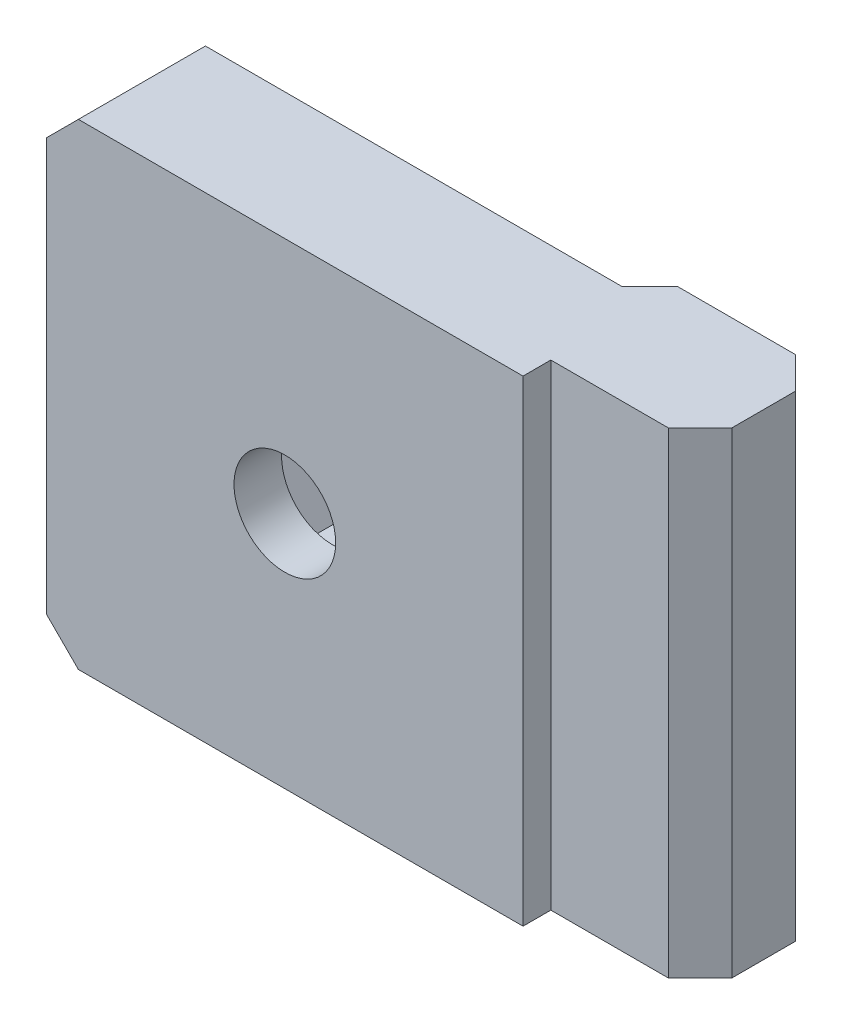
ISO-10303-21;
HEADER;
FILE_DESCRIPTION(('STEP AP214'),'2;1');
FILE_NAME('part.step','',(''),(''),'','','');
FILE_SCHEMA(('AUTOMOTIVE_DESIGN { 1 0 10303 214 1 1 1 1 }'));
ENDSEC;
DATA;
#1=APPLICATION_CONTEXT('core data for automotive mechanical design processes');
#2=APPLICATION_PROTOCOL_DEFINITION('international standard','automotive_design',2000,#1);
#3=PRODUCT_CONTEXT('',#1,'mechanical');
#4=PRODUCT('Part','Part','',(#3));
#5=PRODUCT_RELATED_PRODUCT_CATEGORY('part','',(#4));
#6=PRODUCT_DEFINITION_FORMATION('','',#4);
#7=PRODUCT_DEFINITION_CONTEXT('part definition',#1,'design');
#8=PRODUCT_DEFINITION('design','',#6,#7);
#9=PRODUCT_DEFINITION_SHAPE('','',#8);
#10=(LENGTH_UNIT() NAMED_UNIT(*) SI_UNIT(.MILLI.,.METRE.));
#11=(NAMED_UNIT(*) PLANE_ANGLE_UNIT() SI_UNIT($,.RADIAN.));
#12=(NAMED_UNIT(*) SI_UNIT($,.STERADIAN.) SOLID_ANGLE_UNIT());
#13=UNCERTAINTY_MEASURE_WITH_UNIT(LENGTH_MEASURE(1.E-05),#10,'distance_accuracy_value','');
#14=(GEOMETRIC_REPRESENTATION_CONTEXT(3) GLOBAL_UNCERTAINTY_ASSIGNED_CONTEXT((#13)) GLOBAL_UNIT_ASSIGNED_CONTEXT((#10,
#11,#12)) REPRESENTATION_CONTEXT('',''));
#15=CARTESIAN_POINT('',(0.,0.,0.));
#16=DIRECTION('',(0.,0.,1.));
#17=DIRECTION('',(1.,0.,0.));
#18=AXIS2_PLACEMENT_3D('',#15,#16,#17);
#19=CARTESIAN_POINT('',(0.,15.,-1.75));
#20=DIRECTION('',(-1.,0.,0.));
#21=DIRECTION('',(0.,0.,1.));
#22=AXIS2_PLACEMENT_3D('',#19,#20,#21);
#23=PLANE('',#22);
#24=DIRECTION('',(0.,0.,-1.));
#25=VECTOR('',#24,1.);
#26=CARTESIAN_POINT('',(0.,-15.,-1.75));
#27=LINE('',#26,#25);
#28=CARTESIAN_POINT('',(0.,-15.,0.));
#29=VERTEX_POINT('',#28);
#30=CARTESIAN_POINT('',(0.,-15.,-1.75));
#31=VERTEX_POINT('',#30);
#32=EDGE_CURVE('E210',#29,#31,#27,.T.);
#33=ORIENTED_EDGE('',*,*,#32,.T.);
#34=DIRECTION('',(0.,-1.,0.));
#35=VECTOR('',#34,1.);
#36=CARTESIAN_POINT('',(0.,15.,-1.75));
#37=LINE('',#36,#35);
#38=CARTESIAN_POINT('',(0.,15.,-1.75));
#39=VERTEX_POINT('',#38);
#40=EDGE_CURVE('E259',#39,#31,#37,.T.);
#41=ORIENTED_EDGE('',*,*,#40,.F.);
#42=DIRECTION('',(0.,0.,-1.));
#43=VECTOR('',#42,1.);
#44=CARTESIAN_POINT('',(0.,15.,-1.75));
#45=LINE('',#44,#43);
#46=CARTESIAN_POINT('',(0.,15.,0.));
#47=VERTEX_POINT('',#46);
#48=EDGE_CURVE('E211',#47,#39,#45,.T.);
#49=ORIENTED_EDGE('',*,*,#48,.F.);
#50=DIRECTION('',(0.,-1.,0.));
#51=VECTOR('',#50,1.);
#52=CARTESIAN_POINT('',(0.,15.,0.));
#53=LINE('',#52,#51);
#54=EDGE_CURVE('E230',#47,#29,#53,.T.);
#55=ORIENTED_EDGE('',*,*,#54,.T.);
#56=EDGE_LOOP('',(#33,#41,#49,#55));
#57=FACE_BOUND('',#56,.T.);
#58=ADVANCED_FACE('F35',(#57),#23,.F.);
#59=CARTESIAN_POINT('',(9.4,15.,-1.75));
#60=DIRECTION('',(0.,0.,-1.));
#61=DIRECTION('',(-1.,0.,0.));
#62=AXIS2_PLACEMENT_3D('',#59,#60,#61);
#63=PLANE('',#62);
#64=DIRECTION('',(1.,0.,0.));
#65=VECTOR('',#64,1.);
#66=CARTESIAN_POINT('',(9.4,-15.,-1.75));
#67=LINE('',#66,#65);
#68=CARTESIAN_POINT('',(7.39999999999999,-15.,-1.75));
#69=VERTEX_POINT('',#68);
#70=EDGE_CURVE('E233',#31,#69,#67,.T.);
#71=ORIENTED_EDGE('',*,*,#70,.T.);
#72=DIRECTION('',(0.,1.,0.));
#73=VECTOR('',#72,1.);
#74=CARTESIAN_POINT('',(7.39999999999999,15.,-1.75));
#75=LINE('',#74,#73);
#76=CARTESIAN_POINT('',(7.39999999999999,15.,-1.75));
#77=VERTEX_POINT('',#76);
#78=EDGE_CURVE('E290',#69,#77,#75,.T.);
#79=ORIENTED_EDGE('',*,*,#78,.T.);
#80=DIRECTION('',(1.,0.,0.));
#81=VECTOR('',#80,1.);
#82=CARTESIAN_POINT('',(9.4,15.,-1.75));
#83=LINE('',#82,#81);
#84=EDGE_CURVE('E214',#39,#77,#83,.T.);
#85=ORIENTED_EDGE('',*,*,#84,.F.);
#86=ORIENTED_EDGE('',*,*,#40,.T.);
#87=EDGE_LOOP('',(#71,#79,#85,#86));
#88=FACE_BOUND('',#87,.T.);
#89=ADVANCED_FACE('F368',(#88),#63,.F.);
#90=CARTESIAN_POINT('',(9.4,15.,-9.75));
#91=DIRECTION('',(-1.,0.,0.));
#92=DIRECTION('',(0.,0.,1.));
#93=AXIS2_PLACEMENT_3D('',#90,#91,#92);
#94=PLANE('',#93);
#95=DIRECTION('',(0.,0.,-1.));
#96=VECTOR('',#95,1.);
#97=CARTESIAN_POINT('',(9.4,15.,-9.75));
#98=LINE('',#97,#96);
#99=CARTESIAN_POINT('',(9.4,15.,-3.75000000000001));
#100=VERTEX_POINT('',#99);
#101=CARTESIAN_POINT('',(9.4,15.,-7.74999999999999));
#102=VERTEX_POINT('',#101);
#103=EDGE_CURVE('E218',#100,#102,#98,.T.);
#104=ORIENTED_EDGE('',*,*,#103,.F.);
#105=DIRECTION('',(0.,-1.,0.));
#106=VECTOR('',#105,1.);
#107=CARTESIAN_POINT('',(9.4,15.,-3.75000000000001));
#108=LINE('',#107,#106);
#109=CARTESIAN_POINT('',(9.4,-15.,-3.75000000000001));
#110=VERTEX_POINT('',#109);
#111=EDGE_CURVE('E281',#100,#110,#108,.T.);
#112=ORIENTED_EDGE('',*,*,#111,.T.);
#113=DIRECTION('',(0.,0.,-1.));
#114=VECTOR('',#113,1.);
#115=CARTESIAN_POINT('',(9.4,-15.,-9.75));
#116=LINE('',#115,#114);
#117=CARTESIAN_POINT('',(9.4,-15.,-7.74999999999999));
#118=VERTEX_POINT('',#117);
#119=EDGE_CURVE('E236',#110,#118,#116,.T.);
#120=ORIENTED_EDGE('',*,*,#119,.T.);
#121=DIRECTION('',(0.,1.,0.));
#122=VECTOR('',#121,1.);
#123=CARTESIAN_POINT('',(9.4,15.,-7.74999999999999));
#124=LINE('',#123,#122);
#125=EDGE_CURVE('E279',#118,#102,#124,.T.);
#126=ORIENTED_EDGE('',*,*,#125,.T.);
#127=EDGE_LOOP('',(#104,#112,#120,#126));
#128=FACE_BOUND('',#127,.T.);
#129=ADVANCED_FACE('F344',(#128),#94,.F.);
#130=CARTESIAN_POINT('',(0.,15.,-9.75));
#131=DIRECTION('',(0.,0.,1.));
#132=DIRECTION('',(1.,0.,0.));
#133=AXIS2_PLACEMENT_3D('',#130,#131,#132);
#134=PLANE('',#133);
#135=DIRECTION('',(-1.,0.,0.));
#136=VECTOR('',#135,1.);
#137=CARTESIAN_POINT('',(0.,15.,-9.75));
#138=LINE('',#137,#136);
#139=CARTESIAN_POINT('',(7.4,15.,-9.75));
#140=VERTEX_POINT('',#139);
#141=CARTESIAN_POINT('',(0.,15.,-9.75));
#142=VERTEX_POINT('',#141);
#143=EDGE_CURVE('E221',#140,#142,#138,.T.);
#144=ORIENTED_EDGE('',*,*,#143,.F.);
#145=DIRECTION('',(0.,-1.,0.));
#146=VECTOR('',#145,1.);
#147=CARTESIAN_POINT('',(7.4,15.,-9.75));
#148=LINE('',#147,#146);
#149=CARTESIAN_POINT('',(7.4,-15.,-9.75));
#150=VERTEX_POINT('',#149);
#151=EDGE_CURVE('E299',#140,#150,#148,.T.);
#152=ORIENTED_EDGE('',*,*,#151,.T.);
#153=DIRECTION('',(-1.,0.,0.));
#154=VECTOR('',#153,1.);
#155=CARTESIAN_POINT('',(0.,-15.,-9.75));
#156=LINE('',#155,#154);
#157=CARTESIAN_POINT('',(0.,-15.,-9.75));
#158=VERTEX_POINT('',#157);
#159=EDGE_CURVE('E239',#150,#158,#156,.T.);
#160=ORIENTED_EDGE('',*,*,#159,.T.);
#161=DIRECTION('',(0.,-1.,0.));
#162=VECTOR('',#161,1.);
#163=CARTESIAN_POINT('',(0.,15.,-9.75));
#164=LINE('',#163,#162);
#165=EDGE_CURVE('E256',#142,#158,#164,.T.);
#166=ORIENTED_EDGE('',*,*,#165,.F.);
#167=EDGE_LOOP('',(#144,#152,#160,#166));
#168=FACE_BOUND('',#167,.T.);
#169=ADVANCED_FACE('F354',(#168),#134,.F.);
#170=CARTESIAN_POINT('',(-1.75,15.,-8.));
#171=DIRECTION('',(0.707106781186549,0.,0.707106781186546));
#172=DIRECTION('',(0.707106781186546,0.,-0.707106781186549));
#173=AXIS2_PLACEMENT_3D('',#170,#171,#172);
#174=PLANE('',#173);
#175=DIRECTION('',(-0.707106781186546,0.,0.707106781186549));
#176=VECTOR('',#175,1.);
#177=CARTESIAN_POINT('',(-1.75,-15.,-8.));
#178=LINE('',#177,#176);
#179=CARTESIAN_POINT('',(-1.75,-15.,-8.));
#180=VERTEX_POINT('',#179);
#181=EDGE_CURVE('E241',#158,#180,#178,.T.);
#182=ORIENTED_EDGE('',*,*,#181,.T.);
#183=DIRECTION('',(0.,-1.,0.));
#184=VECTOR('',#183,1.);
#185=CARTESIAN_POINT('',(-1.75,15.,-8.));
#186=LINE('',#185,#184);
#187=CARTESIAN_POINT('',(-1.75,15.,-8.));
#188=VERTEX_POINT('',#187);
#189=EDGE_CURVE('E253',#188,#180,#186,.T.);
#190=ORIENTED_EDGE('',*,*,#189,.F.);
#191=DIRECTION('',(-0.707106781186546,0.,0.707106781186549));
#192=VECTOR('',#191,1.);
#193=CARTESIAN_POINT('',(-1.75,15.,-8.));
#194=LINE('',#193,#192);
#195=EDGE_CURVE('E223',#142,#188,#194,.T.);
#196=ORIENTED_EDGE('',*,*,#195,.F.);
#197=ORIENTED_EDGE('',*,*,#165,.T.);
#198=EDGE_LOOP('',(#182,#190,#196,#197));
#199=FACE_BOUND('',#198,.T.);
#200=ADVANCED_FACE('F357',(#199),#174,.F.);
#201=CARTESIAN_POINT('',(-30.,15.,-8.));
#202=DIRECTION('',(0.,0.,1.));
#203=DIRECTION('',(1.,0.,0.));
#204=AXIS2_PLACEMENT_3D('',#201,#202,#203);
#205=PLANE('',#204);
#206=DIRECTION('',(1.,0.,0.));
#207=VECTOR('',#206,1.);
#208=CARTESIAN_POINT('',(-30.,-5.,-8.));
#209=LINE('',#208,#207);
#210=CARTESIAN_POINT('',(-17.8867513459481,-5.,-8.));
#211=VERTEX_POINT('',#210);
#212=CARTESIAN_POINT('',(-12.1132486540519,-5.00000000000001,-8.));
#213=VERTEX_POINT('',#212);
#214=EDGE_CURVE('E274',#211,#213,#209,.T.);
#215=ORIENTED_EDGE('',*,*,#214,.T.);
#216=DIRECTION('',(0.5,0.866025403784439,0.));
#217=VECTOR('',#216,1.);
#218=CARTESIAN_POINT('',(-7.92468245269451,2.25480947161672,-8.));
#219=LINE('',#218,#217);
#220=CARTESIAN_POINT('',(-9.22649730810374,0.,-8.));
#221=VERTEX_POINT('',#220);
#222=EDGE_CURVE('E277',#213,#221,#219,.T.);
#223=ORIENTED_EDGE('',*,*,#222,.T.);
#224=DIRECTION('',(-0.5,0.866025403784439,0.));
#225=VECTOR('',#224,1.);
#226=CARTESIAN_POINT('',(-20.9150635094611,20.2451905283833,-8.));
#227=LINE('',#226,#225);
#228=CARTESIAN_POINT('',(-12.1132486540519,5.,-8.));
#229=VERTEX_POINT('',#228);
#230=EDGE_CURVE('E166',#221,#229,#227,.T.);
#231=ORIENTED_EDGE('',*,*,#230,.T.);
#232=DIRECTION('',(-1.,0.,0.));
#233=VECTOR('',#232,1.);
#234=CARTESIAN_POINT('',(-30.,5.,-8.));
#235=LINE('',#234,#233);
#236=CARTESIAN_POINT('',(-17.8867513459481,5.,-8.));
#237=VERTEX_POINT('',#236);
#238=EDGE_CURVE('E265',#229,#237,#235,.T.);
#239=ORIENTED_EDGE('',*,*,#238,.T.);
#240=DIRECTION('',(-0.5,-0.866025403784439,0.));
#241=VECTOR('',#240,1.);
#242=CARTESIAN_POINT('',(-16.5849364905389,7.25480947161671,-8.));
#243=LINE('',#242,#241);
#244=CARTESIAN_POINT('',(-20.7735026918963,0.,-8.));
#245=VERTEX_POINT('',#244);
#246=EDGE_CURVE('E268',#237,#245,#243,.T.);
#247=ORIENTED_EDGE('',*,*,#246,.T.);
#248=DIRECTION('',(0.5,-0.866025403784439,0.));
#249=VECTOR('',#248,1.);
#250=CARTESIAN_POINT('',(-29.5753175473055,15.2451905283833,-8.));
#251=LINE('',#250,#249);
#252=EDGE_CURVE('E271',#245,#211,#251,.T.);
#253=ORIENTED_EDGE('',*,*,#252,.T.);
#254=EDGE_LOOP('',(#215,#223,#231,#239,#247,#253));
#255=FACE_BOUND('',#254,.T.);
#256=DIRECTION('',(-1.,0.,0.));
#257=VECTOR('',#256,1.);
#258=CARTESIAN_POINT('',(-30.,-15.,-8.));
#259=LINE('',#258,#257);
#260=CARTESIAN_POINT('',(-28.,-15.,-8.));
#261=VERTEX_POINT('',#260);
#262=EDGE_CURVE('E243',#180,#261,#259,.T.);
#263=ORIENTED_EDGE('',*,*,#262,.T.);
#264=DIRECTION('',(-0.707106781186548,0.707106781186548,0.));
#265=VECTOR('',#264,1.);
#266=CARTESIAN_POINT('',(-30.,-13.,-8.));
#267=LINE('',#266,#265);
#268=CARTESIAN_POINT('',(-30.,-13.,-8.));
#269=VERTEX_POINT('',#268);
#270=EDGE_CURVE('E11',#261,#269,#267,.T.);
#271=ORIENTED_EDGE('',*,*,#270,.T.);
#272=DIRECTION('',(0.,-1.,0.));
#273=VECTOR('',#272,1.);
#274=CARTESIAN_POINT('',(-30.,15.,-8.));
#275=LINE('',#274,#273);
#276=CARTESIAN_POINT('',(-30.,13.,-8.));
#277=VERTEX_POINT('',#276);
#278=EDGE_CURVE('E251',#277,#269,#275,.T.);
#279=ORIENTED_EDGE('',*,*,#278,.F.);
#280=DIRECTION('',(-0.707106781186548,-0.707106781186548,0.));
#281=VECTOR('',#280,1.);
#282=CARTESIAN_POINT('',(-28.,15.,-8.));
#283=LINE('',#282,#281);
#284=CARTESIAN_POINT('',(-28.,15.,-8.));
#285=VERTEX_POINT('',#284);
#286=EDGE_CURVE('E44',#277,#285,#283,.F.);
#287=ORIENTED_EDGE('',*,*,#286,.T.);
#288=DIRECTION('',(-1.,0.,0.));
#289=VECTOR('',#288,1.);
#290=CARTESIAN_POINT('',(-30.,15.,-8.));
#291=LINE('',#290,#289);
#292=EDGE_CURVE('E225',#188,#285,#291,.T.);
#293=ORIENTED_EDGE('',*,*,#292,.F.);
#294=ORIENTED_EDGE('',*,*,#189,.T.);
#295=EDGE_LOOP('',(#263,#271,#279,#287,#293,#294));
#296=FACE_BOUND('',#295,.T.);
#297=ADVANCED_FACE('F311',(#255,#296),#205,.F.);
#298=CARTESIAN_POINT('',(-30.,15.,0.));
#299=DIRECTION('',(1.,0.,0.));
#300=DIRECTION('',(0.,0.,-1.));
#301=AXIS2_PLACEMENT_3D('',#298,#299,#300);
#302=PLANE('',#301);
#303=ORIENTED_EDGE('',*,*,#278,.T.);
#304=DIRECTION('',(0.,0.,1.));
#305=VECTOR('',#304,1.);
#306=CARTESIAN_POINT('',(-30.,-13.,0.));
#307=LINE('',#306,#305);
#308=CARTESIAN_POINT('',(-30.,-13.,0.));
#309=VERTEX_POINT('',#308);
#310=EDGE_CURVE('E303',#269,#309,#307,.T.);
#311=ORIENTED_EDGE('',*,*,#310,.T.);
#312=DIRECTION('',(0.,-1.,0.));
#313=VECTOR('',#312,1.);
#314=CARTESIAN_POINT('',(-30.,15.,0.));
#315=LINE('',#314,#313);
#316=CARTESIAN_POINT('',(-30.,13.,0.));
#317=VERTEX_POINT('',#316);
#318=EDGE_CURVE('E248',#317,#309,#315,.T.);
#319=ORIENTED_EDGE('',*,*,#318,.F.);
#320=DIRECTION('',(0.,0.,-1.));
#321=VECTOR('',#320,1.);
#322=CARTESIAN_POINT('',(-30.,13.,0.));
#323=LINE('',#322,#321);
#324=EDGE_CURVE('E56',#317,#277,#323,.T.);
#325=ORIENTED_EDGE('',*,*,#324,.T.);
#326=EDGE_LOOP('',(#303,#311,#319,#325));
#327=FACE_BOUND('',#326,.T.);
#328=ADVANCED_FACE('F322',(#327),#302,.F.);
#329=CARTESIAN_POINT('',(0.,15.,0.));
#330=DIRECTION('',(0.,0.,-1.));
#331=DIRECTION('',(-1.,0.,0.));
#332=AXIS2_PLACEMENT_3D('',#329,#330,#331);
#333=PLANE('',#332);
#334=CARTESIAN_POINT('',(-15.,0.,0.));
#335=DIRECTION('',(0.,0.,1.));
#336=DIRECTION('',(1.,0.,0.));
#337=AXIS2_PLACEMENT_3D('',#334,#335,#336);
#338=CIRCLE('',#337,3.2);
#339=CARTESIAN_POINT('',(-11.8,0.,0.));
#340=VERTEX_POINT('',#339);
#341=EDGE_CURVE('E207',#340,#340,#338,.T.);
#342=ORIENTED_EDGE('',*,*,#341,.F.);
#343=EDGE_LOOP('',(#342));
#344=FACE_BOUND('',#343,.T.);
#345=ORIENTED_EDGE('',*,*,#318,.T.);
#346=DIRECTION('',(0.707106781186548,-0.707106781186548,0.));
#347=VECTOR('',#346,1.);
#348=CARTESIAN_POINT('',(-30.,-13.,0.));
#349=LINE('',#348,#347);
#350=CARTESIAN_POINT('',(-28.,-15.,0.));
#351=VERTEX_POINT('',#350);
#352=EDGE_CURVE('E308',#309,#351,#349,.T.);
#353=ORIENTED_EDGE('',*,*,#352,.T.);
#354=DIRECTION('',(1.,0.,0.));
#355=VECTOR('',#354,1.);
#356=CARTESIAN_POINT('',(0.,-15.,0.));
#357=LINE('',#356,#355);
#358=EDGE_CURVE('E215',#351,#29,#357,.T.);
#359=ORIENTED_EDGE('',*,*,#358,.T.);
#360=ORIENTED_EDGE('',*,*,#54,.F.);
#361=DIRECTION('',(1.,0.,0.));
#362=VECTOR('',#361,1.);
#363=CARTESIAN_POINT('',(0.,15.,0.));
#364=LINE('',#363,#362);
#365=CARTESIAN_POINT('',(-28.,15.,0.));
#366=VERTEX_POINT('',#365);
#367=EDGE_CURVE('E228',#366,#47,#364,.T.);
#368=ORIENTED_EDGE('',*,*,#367,.F.);
#369=DIRECTION('',(0.707106781186548,0.707106781186548,0.));
#370=VECTOR('',#369,1.);
#371=CARTESIAN_POINT('',(-28.,15.,0.));
#372=LINE('',#371,#370);
#373=EDGE_CURVE('E306',#366,#317,#372,.F.);
#374=ORIENTED_EDGE('',*,*,#373,.T.);
#375=EDGE_LOOP('',(#345,#353,#359,#360,#368,#374));
#376=FACE_BOUND('',#375,.T.);
#377=ADVANCED_FACE('F320',(#344,#376),#333,.F.);
#378=CARTESIAN_POINT('',(0.,15.,0.));
#379=DIRECTION('',(0.,-1.,0.));
#380=DIRECTION('',(0.,0.,-1.));
#381=AXIS2_PLACEMENT_3D('',#378,#379,#380);
#382=PLANE('',#381);
#383=ORIENTED_EDGE('',*,*,#84,.T.);
#384=DIRECTION('',(-0.707106781186549,0.,0.707106781186546));
#385=VECTOR('',#384,1.);
#386=CARTESIAN_POINT('',(9.4,15.,-3.75000000000001));
#387=LINE('',#386,#385);
#388=EDGE_CURVE('E297',#77,#100,#387,.F.);
#389=ORIENTED_EDGE('',*,*,#388,.T.);
#390=ORIENTED_EDGE('',*,*,#103,.T.);
#391=DIRECTION('',(0.707106781186546,0.,0.707106781186549));
#392=VECTOR('',#391,1.);
#393=CARTESIAN_POINT('',(7.4,15.,-9.75));
#394=LINE('',#393,#392);
#395=EDGE_CURVE('E295',#102,#140,#394,.F.);
#396=ORIENTED_EDGE('',*,*,#395,.T.);
#397=ORIENTED_EDGE('',*,*,#143,.T.);
#398=ORIENTED_EDGE('',*,*,#195,.T.);
#399=ORIENTED_EDGE('',*,*,#292,.T.);
#400=DIRECTION('',(0.,0.,1.));
#401=VECTOR('',#400,1.);
#402=CARTESIAN_POINT('',(-28.,15.,0.));
#403=LINE('',#402,#401);
#404=EDGE_CURVE('E292',#285,#366,#403,.T.);
#405=ORIENTED_EDGE('',*,*,#404,.T.);
#406=ORIENTED_EDGE('',*,*,#367,.T.);
#407=ORIENTED_EDGE('',*,*,#48,.T.);
#408=EDGE_LOOP('',(#383,#389,#390,#396,#397,#398,#399,#405,#406,#407));
#409=FACE_BOUND('',#408,.T.);
#410=ADVANCED_FACE('F315',(#409),#382,.F.);
#411=CARTESIAN_POINT('',(0.,-15.,0.));
#412=DIRECTION('',(0.,-1.,0.));
#413=DIRECTION('',(0.,0.,-1.));
#414=AXIS2_PLACEMENT_3D('',#411,#412,#413);
#415=PLANE('',#414);
#416=ORIENTED_EDGE('',*,*,#119,.F.);
#417=DIRECTION('',(0.707106781186549,0.,-0.707106781186546));
#418=VECTOR('',#417,1.);
#419=CARTESIAN_POINT('',(2.82499999999998,-15.,2.82499999999999));
#420=LINE('',#419,#418);
#421=EDGE_CURVE('E288',#110,#69,#420,.F.);
#422=ORIENTED_EDGE('',*,*,#421,.T.);
#423=ORIENTED_EDGE('',*,*,#70,.F.);
#424=ORIENTED_EDGE('',*,*,#32,.F.);
#425=ORIENTED_EDGE('',*,*,#358,.F.);
#426=DIRECTION('',(0.,0.,-1.));
#427=VECTOR('',#426,1.);
#428=CARTESIAN_POINT('',(-28.,-15.,-8.));
#429=LINE('',#428,#427);
#430=EDGE_CURVE('E284',#351,#261,#429,.T.);
#431=ORIENTED_EDGE('',*,*,#430,.T.);
#432=ORIENTED_EDGE('',*,*,#262,.F.);
#433=ORIENTED_EDGE('',*,*,#181,.F.);
#434=ORIENTED_EDGE('',*,*,#159,.F.);
#435=DIRECTION('',(-0.707106781186546,0.,-0.707106781186549));
#436=VECTOR('',#435,1.);
#437=CARTESIAN_POINT('',(8.57500000000001,-15.,-8.57499999999999));
#438=LINE('',#437,#436);
#439=EDGE_CURVE('E286',#150,#118,#438,.F.);
#440=ORIENTED_EDGE('',*,*,#439,.T.);
#441=EDGE_LOOP('',(#416,#422,#423,#424,#425,#431,#432,#433,#434,#440));
#442=FACE_BOUND('',#441,.T.);
#443=ADVANCED_FACE('F331',(#442),#415,.T.);
#444=CARTESIAN_POINT('',(-15.,0.,-9.75));
#445=DIRECTION('',(0.,0.,1.));
#446=DIRECTION('',(1.,0.,0.));
#447=AXIS2_PLACEMENT_3D('',#444,#445,#446);
#448=CYLINDRICAL_SURFACE('',#447,3.2);
#449=CARTESIAN_POINT('',(-15.,0.,-3.));
#450=DIRECTION('',(0.,0.,1.));
#451=DIRECTION('',(1.,0.,0.));
#452=AXIS2_PLACEMENT_3D('',#449,#450,#451);
#453=CIRCLE('',#452,3.2);
#454=CARTESIAN_POINT('',(-11.8,0.,-3.));
#455=VERTEX_POINT('',#454);
#456=EDGE_CURVE('E199',#455,#455,#453,.F.);
#457=ORIENTED_EDGE('',*,*,#456,.T.);
#458=EDGE_LOOP('',(#457));
#459=FACE_BOUND('',#458,.T.);
#460=ORIENTED_EDGE('',*,*,#341,.T.);
#461=EDGE_LOOP('',(#460));
#462=FACE_BOUND('',#461,.T.);
#463=ADVANCED_FACE('F421',(#459,#462),#448,.F.);
#464=CARTESIAN_POINT('',(-12.1132486540519,-5.00000000000001,-9.75));
#465=DIRECTION('',(0.866025403784439,-0.5,0.));
#466=DIRECTION('',(0.5,0.866025403784439,0.));
#467=AXIS2_PLACEMENT_3D('',#464,#465,#466);
#468=PLANE('',#467);
#469=DIRECTION('',(0.,0.,1.));
#470=VECTOR('',#469,1.);
#471=CARTESIAN_POINT('',(-12.1132486540519,-5.00000000000001,-9.75));
#472=LINE('',#471,#470);
#473=CARTESIAN_POINT('',(-12.1132486540519,-5.00000000000001,-3.));
#474=VERTEX_POINT('',#473);
#475=EDGE_CURVE('E187',#213,#474,#472,.T.);
#476=ORIENTED_EDGE('',*,*,#475,.T.);
#477=DIRECTION('',(0.5,0.866025403784439,0.));
#478=VECTOR('',#477,1.);
#479=CARTESIAN_POINT('',(-12.1132486540519,-5.00000000000001,-3.));
#480=LINE('',#479,#478);
#481=CARTESIAN_POINT('',(-9.22649730810374,0.,-3.));
#482=VERTEX_POINT('',#481);
#483=EDGE_CURVE('E179',#474,#482,#480,.T.);
#484=ORIENTED_EDGE('',*,*,#483,.T.);
#485=DIRECTION('',(0.,0.,1.));
#486=VECTOR('',#485,1.);
#487=CARTESIAN_POINT('',(-9.22649730810374,0.,-9.75));
#488=LINE('',#487,#486);
#489=EDGE_CURVE('E161',#221,#482,#488,.T.);
#490=ORIENTED_EDGE('',*,*,#489,.F.);
#491=ORIENTED_EDGE('',*,*,#222,.F.);
#492=EDGE_LOOP('',(#476,#484,#490,#491));
#493=FACE_BOUND('',#492,.T.);
#494=ADVANCED_FACE('F185',(#493),#468,.F.);
#495=CARTESIAN_POINT('',(-17.8867513459481,-5.,-9.75));
#496=DIRECTION('',(0.,-1.,0.));
#497=DIRECTION('',(1.,0.,0.));
#498=AXIS2_PLACEMENT_3D('',#495,#496,#497);
#499=PLANE('',#498);
#500=DIRECTION('',(0.,0.,1.));
#501=VECTOR('',#500,1.);
#502=CARTESIAN_POINT('',(-17.8867513459481,-5.,-9.75));
#503=LINE('',#502,#501);
#504=CARTESIAN_POINT('',(-17.8867513459481,-5.,-3.));
#505=VERTEX_POINT('',#504);
#506=EDGE_CURVE('E200',#211,#505,#503,.T.);
#507=ORIENTED_EDGE('',*,*,#506,.T.);
#508=DIRECTION('',(1.,0.,0.));
#509=VECTOR('',#508,1.);
#510=CARTESIAN_POINT('',(-17.8867513459481,-5.,-3.));
#511=LINE('',#510,#509);
#512=EDGE_CURVE('E171',#505,#474,#511,.T.);
#513=ORIENTED_EDGE('',*,*,#512,.T.);
#514=ORIENTED_EDGE('',*,*,#475,.F.);
#515=ORIENTED_EDGE('',*,*,#214,.F.);
#516=EDGE_LOOP('',(#507,#513,#514,#515));
#517=FACE_BOUND('',#516,.T.);
#518=ADVANCED_FACE('F519',(#517),#499,.F.);
#519=CARTESIAN_POINT('',(-20.7735026918963,0.,-9.75));
#520=DIRECTION('',(-0.866025403784439,-0.5,0.));
#521=DIRECTION('',(0.5,-0.866025403784439,0.));
#522=AXIS2_PLACEMENT_3D('',#519,#520,#521);
#523=PLANE('',#522);
#524=DIRECTION('',(0.,0.,1.));
#525=VECTOR('',#524,1.);
#526=CARTESIAN_POINT('',(-20.7735026918963,0.,-9.75));
#527=LINE('',#526,#525);
#528=CARTESIAN_POINT('',(-20.7735026918963,0.,-3.));
#529=VERTEX_POINT('',#528);
#530=EDGE_CURVE('E202',#245,#529,#527,.T.);
#531=ORIENTED_EDGE('',*,*,#530,.T.);
#532=DIRECTION('',(0.5,-0.866025403784438,0.));
#533=VECTOR('',#532,1.);
#534=CARTESIAN_POINT('',(-20.7735026918963,0.,-3.));
#535=LINE('',#534,#533);
#536=EDGE_CURVE('E194',#529,#505,#535,.T.);
#537=ORIENTED_EDGE('',*,*,#536,.T.);
#538=ORIENTED_EDGE('',*,*,#506,.F.);
#539=ORIENTED_EDGE('',*,*,#252,.F.);
#540=EDGE_LOOP('',(#531,#537,#538,#539));
#541=FACE_BOUND('',#540,.T.);
#542=ADVANCED_FACE('F509',(#541),#523,.F.);
#543=CARTESIAN_POINT('',(-17.8867513459481,5.,-9.75));
#544=DIRECTION('',(-0.866025403784439,0.5,0.));
#545=DIRECTION('',(-0.5,-0.866025403784439,0.));
#546=AXIS2_PLACEMENT_3D('',#543,#544,#545);
#547=PLANE('',#546);
#548=DIRECTION('',(0.,0.,1.));
#549=VECTOR('',#548,1.);
#550=CARTESIAN_POINT('',(-17.8867513459481,5.,-9.75));
#551=LINE('',#550,#549);
#552=CARTESIAN_POINT('',(-17.8867513459481,5.,-3.));
#553=VERTEX_POINT('',#552);
#554=EDGE_CURVE('E204',#237,#553,#551,.T.);
#555=ORIENTED_EDGE('',*,*,#554,.T.);
#556=DIRECTION('',(-0.5,-0.866025403784439,0.));
#557=VECTOR('',#556,1.);
#558=CARTESIAN_POINT('',(-17.8867513459481,5.,-3.));
#559=LINE('',#558,#557);
#560=EDGE_CURVE('E191',#553,#529,#559,.T.);
#561=ORIENTED_EDGE('',*,*,#560,.T.);
#562=ORIENTED_EDGE('',*,*,#530,.F.);
#563=ORIENTED_EDGE('',*,*,#246,.F.);
#564=EDGE_LOOP('',(#555,#561,#562,#563));
#565=FACE_BOUND('',#564,.T.);
#566=ADVANCED_FACE('F499',(#565),#547,.F.);
#567=CARTESIAN_POINT('',(-12.1132486540519,5.,-9.75));
#568=DIRECTION('',(0.,1.,0.));
#569=DIRECTION('',(0.,0.,1.));
#570=AXIS2_PLACEMENT_3D('',#567,#568,#569);
#571=PLANE('',#570);
#572=DIRECTION('',(0.,0.,1.));
#573=VECTOR('',#572,1.);
#574=CARTESIAN_POINT('',(-12.1132486540519,5.,-9.75));
#575=LINE('',#574,#573);
#576=CARTESIAN_POINT('',(-12.1132486540519,5.,-3.));
#577=VERTEX_POINT('',#576);
#578=EDGE_CURVE('E170',#229,#577,#575,.T.);
#579=ORIENTED_EDGE('',*,*,#578,.T.);
#580=DIRECTION('',(-1.,0.,0.));
#581=VECTOR('',#580,1.);
#582=CARTESIAN_POINT('',(-12.1132486540519,5.,-3.));
#583=LINE('',#582,#581);
#584=EDGE_CURVE('E183',#577,#553,#583,.T.);
#585=ORIENTED_EDGE('',*,*,#584,.T.);
#586=ORIENTED_EDGE('',*,*,#554,.F.);
#587=ORIENTED_EDGE('',*,*,#238,.F.);
#588=EDGE_LOOP('',(#579,#585,#586,#587));
#589=FACE_BOUND('',#588,.T.);
#590=ADVANCED_FACE('F490',(#589),#571,.F.);
#591=CARTESIAN_POINT('',(-9.22649730810374,0.,-9.75));
#592=DIRECTION('',(0.866025403784439,0.5,0.));
#593=DIRECTION('',(-0.5,0.866025403784439,0.));
#594=AXIS2_PLACEMENT_3D('',#591,#592,#593);
#595=PLANE('',#594);
#596=ORIENTED_EDGE('',*,*,#489,.T.);
#597=DIRECTION('',(-0.5,0.866025403784439,0.));
#598=VECTOR('',#597,1.);
#599=CARTESIAN_POINT('',(-9.22649730810374,0.,-3.));
#600=LINE('',#599,#598);
#601=EDGE_CURVE('E164',#482,#577,#600,.T.);
#602=ORIENTED_EDGE('',*,*,#601,.T.);
#603=ORIENTED_EDGE('',*,*,#578,.F.);
#604=ORIENTED_EDGE('',*,*,#230,.F.);
#605=EDGE_LOOP('',(#596,#602,#603,#604));
#606=FACE_BOUND('',#605,.T.);
#607=ADVANCED_FACE('F163',(#606),#595,.F.);
#608=CARTESIAN_POINT('',(0.,0.,-3.));
#609=DIRECTION('',(0.,0.,1.));
#610=DIRECTION('',(1.,0.,0.));
#611=AXIS2_PLACEMENT_3D('',#608,#609,#610);
#612=PLANE('',#611);
#613=ORIENTED_EDGE('',*,*,#483,.F.);
#614=ORIENTED_EDGE('',*,*,#512,.F.);
#615=ORIENTED_EDGE('',*,*,#536,.F.);
#616=ORIENTED_EDGE('',*,*,#560,.F.);
#617=ORIENTED_EDGE('',*,*,#584,.F.);
#618=ORIENTED_EDGE('',*,*,#601,.F.);
#619=EDGE_LOOP('',(#613,#614,#615,#616,#617,#618));
#620=FACE_BOUND('',#619,.T.);
#621=ORIENTED_EDGE('',*,*,#456,.F.);
#622=EDGE_LOOP('',(#621));
#623=FACE_BOUND('',#622,.T.);
#624=ADVANCED_FACE('F176',(#620,#623),#612,.F.);
#625=CARTESIAN_POINT('',(9.4,15.,-3.75000000000001));
#626=DIRECTION('',(-0.707106781186546,0.,-0.707106781186549));
#627=DIRECTION('',(0.,-1.,0.));
#628=AXIS2_PLACEMENT_3D('',#625,#626,#627);
#629=PLANE('',#628);
#630=ORIENTED_EDGE('',*,*,#388,.F.);
#631=ORIENTED_EDGE('',*,*,#78,.F.);
#632=ORIENTED_EDGE('',*,*,#421,.F.);
#633=ORIENTED_EDGE('',*,*,#111,.F.);
#634=EDGE_LOOP('',(#630,#631,#632,#633));
#635=FACE_BOUND('',#634,.T.);
#636=ADVANCED_FACE('F342',(#635),#629,.F.);
#637=CARTESIAN_POINT('',(7.4,15.,-9.75));
#638=DIRECTION('',(-0.707106781186549,0.,0.707106781186546));
#639=DIRECTION('',(0.,-1.,0.));
#640=AXIS2_PLACEMENT_3D('',#637,#638,#639);
#641=PLANE('',#640);
#642=ORIENTED_EDGE('',*,*,#395,.F.);
#643=ORIENTED_EDGE('',*,*,#125,.F.);
#644=ORIENTED_EDGE('',*,*,#439,.F.);
#645=ORIENTED_EDGE('',*,*,#151,.F.);
#646=EDGE_LOOP('',(#642,#643,#644,#645));
#647=FACE_BOUND('',#646,.T.);
#648=ADVANCED_FACE('F351',(#647),#641,.F.);
#649=CARTESIAN_POINT('',(-30.,-13.,0.));
#650=DIRECTION('',(-0.707106781186547,-0.707106781186547,0.));
#651=DIRECTION('',(0.,0.,-1.));
#652=AXIS2_PLACEMENT_3D('',#649,#650,#651);
#653=PLANE('',#652);
#654=ORIENTED_EDGE('',*,*,#270,.F.);
#655=ORIENTED_EDGE('',*,*,#430,.F.);
#656=ORIENTED_EDGE('',*,*,#352,.F.);
#657=ORIENTED_EDGE('',*,*,#310,.F.);
#658=EDGE_LOOP('',(#654,#655,#656,#657));
#659=FACE_BOUND('',#658,.T.);
#660=ADVANCED_FACE('F325',(#659),#653,.T.);
#661=CARTESIAN_POINT('',(-28.,15.,0.));
#662=DIRECTION('',(0.707106781186548,-0.707106781186548,0.));
#663=DIRECTION('',(0.,0.,1.));
#664=AXIS2_PLACEMENT_3D('',#661,#662,#663);
#665=PLANE('',#664);
#666=ORIENTED_EDGE('',*,*,#286,.F.);
#667=ORIENTED_EDGE('',*,*,#324,.F.);
#668=ORIENTED_EDGE('',*,*,#373,.F.);
#669=ORIENTED_EDGE('',*,*,#404,.F.);
#670=EDGE_LOOP('',(#666,#667,#668,#669));
#671=FACE_BOUND('',#670,.T.);
#672=ADVANCED_FACE('F38',(#671),#665,.F.);
#673=CLOSED_SHELL('',(#58,#89,#129,#169,#200,#297,#328,#377,#410,#443,#463,#494,#518,#542,#566,
#590,#607,#624,#636,#648,#660,#672));
#674=MANIFOLD_SOLID_BREP('B2',#673);
#675=ADVANCED_BREP_SHAPE_REPRESENTATION('',(#18,#674),#14);
#676=SHAPE_DEFINITION_REPRESENTATION(#9,#675);
ENDSEC;
END-ISO-10303-21;
